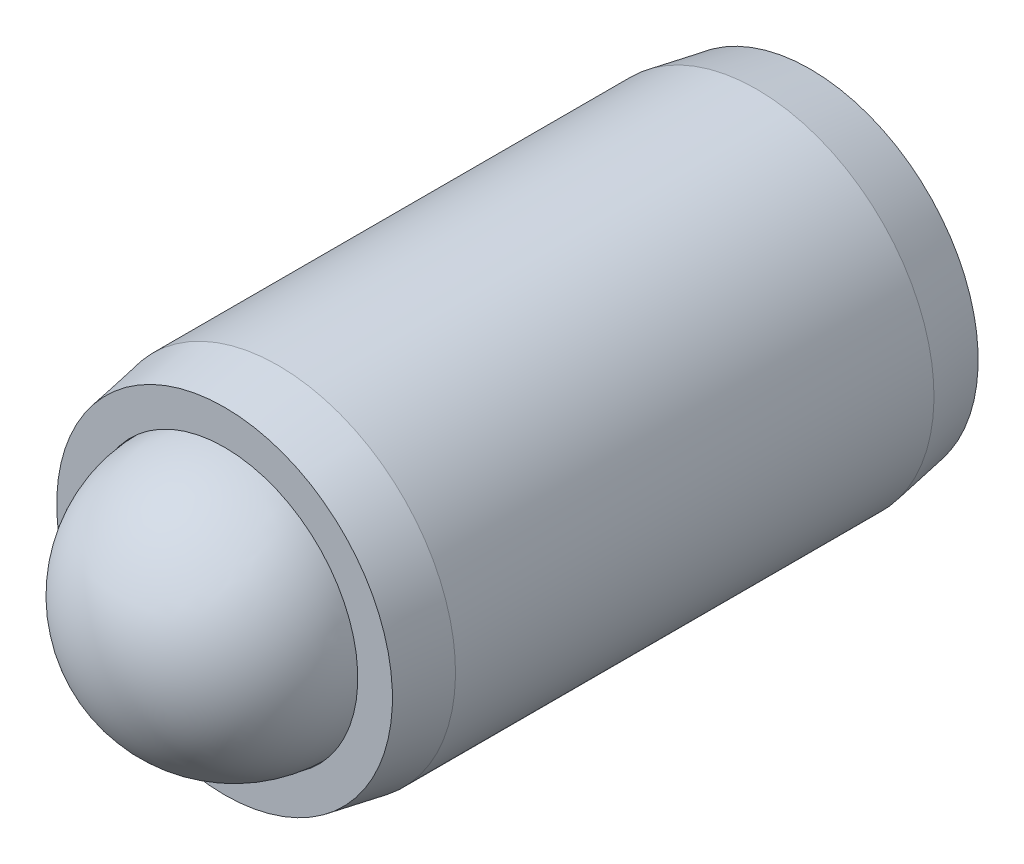
ISO-10303-21;
HEADER;
FILE_DESCRIPTION(('STEP AP214'),'2;1');
FILE_NAME('part.step','',(''),(''),'','','');
FILE_SCHEMA(('AUTOMOTIVE_DESIGN { 1 0 10303 214 1 1 1 1 }'));
ENDSEC;
DATA;
#1=APPLICATION_CONTEXT('core data for automotive mechanical design processes');
#2=APPLICATION_PROTOCOL_DEFINITION('international standard','automotive_design',2000,#1);
#3=PRODUCT_CONTEXT('',#1,'mechanical');
#4=PRODUCT('Part','Part','',(#3));
#5=PRODUCT_RELATED_PRODUCT_CATEGORY('part','',(#4));
#6=PRODUCT_DEFINITION_FORMATION('','',#4);
#7=PRODUCT_DEFINITION_CONTEXT('part definition',#1,'design');
#8=PRODUCT_DEFINITION('design','',#6,#7);
#9=PRODUCT_DEFINITION_SHAPE('','',#8);
#10=(LENGTH_UNIT() NAMED_UNIT(*) SI_UNIT(.MILLI.,.METRE.));
#11=(NAMED_UNIT(*) PLANE_ANGLE_UNIT() SI_UNIT($,.RADIAN.));
#12=(NAMED_UNIT(*) SI_UNIT($,.STERADIAN.) SOLID_ANGLE_UNIT());
#13=UNCERTAINTY_MEASURE_WITH_UNIT(LENGTH_MEASURE(1.E-05),#10,'distance_accuracy_value','');
#14=(GEOMETRIC_REPRESENTATION_CONTEXT(3) GLOBAL_UNCERTAINTY_ASSIGNED_CONTEXT((#13)) GLOBAL_UNIT_ASSIGNED_CONTEXT((#10,
#11,#12)) REPRESENTATION_CONTEXT('',''));
#15=CARTESIAN_POINT('',(0.,0.,0.));
#16=DIRECTION('',(0.,0.,1.));
#17=DIRECTION('',(1.,0.,0.));
#18=AXIS2_PLACEMENT_3D('',#15,#16,#17);
#19=CARTESIAN_POINT('',(3.63880287113716,9.69809230508645,-0.896824962312488));
#20=DIRECTION('',(-0.828677300575052,0.527077894582623,0.188368852398678));
#21=DIRECTION('',(0.543764560000375,0.678290201199728,0.494208970218096));
#22=AXIS2_PLACEMENT_3D('',#19,#20,#21);
#23=SPHERICAL_SURFACE('',#22,3.571875);
#24=CARTESIAN_POINT('',(0.678871138145646,11.5807486597988,-0.223994967650961));
#25=VERTEX_POINT('',#24);
#26=VERTEX_LOOP('',#25);
#27=FACE_BOUND('',#26,.T.);
#28=ADVANCED_FACE('P0_F12',(#27),#23,.T.);
#29=CLOSED_SHELL('',(#28));
#30=MANIFOLD_SOLID_BREP('P0_B1',#29);
#31=CARTESIAN_POINT('',(3.63880287113716,9.69809230508645,-16.3749499623125));
#32=DIRECTION('',(0.,0.,1.));
#33=DIRECTION('',(0.,-1.,0.));
#34=AXIS2_PLACEMENT_3D('',#31,#32,#33);
#35=CONICAL_SURFACE('',#34,4.5085,0.174532925199426);
#36=CARTESIAN_POINT('',(3.63880287113716,9.69809230508645,-14.9344443801295));
#37=DIRECTION('',(0.,0.,-1.));
#38=DIRECTION('',(0.,1.,0.));
#39=AXIS2_PLACEMENT_3D('',#36,#37,#38);
#40=CIRCLE('',#39,4.7625);
#41=CARTESIAN_POINT('',(3.63880287113716,14.4605923050864,-14.9344443801295));
#42=VERTEX_POINT('',#41);
#43=EDGE_CURVE('P1_E149',#42,#42,#40,.T.);
#44=ORIENTED_EDGE('',*,*,#43,.T.);
#45=EDGE_LOOP('',(#44));
#46=FACE_BOUND('',#45,.T.);
#47=CARTESIAN_POINT('',(3.63880287113716,9.69809230508645,-16.3749499623125));
#48=DIRECTION('',(0.,0.,-1.));
#49=DIRECTION('',(0.,1.,0.));
#50=AXIS2_PLACEMENT_3D('',#47,#48,#49);
#51=CIRCLE('',#50,4.5085);
#52=CARTESIAN_POINT('',(3.63880287113716,14.2065923050864,-16.3749499623125));
#53=VERTEX_POINT('',#52);
#54=EDGE_CURVE('P1_E125',#53,#53,#51,.T.);
#55=ORIENTED_EDGE('',*,*,#54,.F.);
#56=EDGE_LOOP('',(#55));
#57=FACE_BOUND('',#56,.T.);
#58=ADVANCED_FACE('P1_F15',(#46,#57),#35,.T.);
#59=CARTESIAN_POINT('',(3.63880287113716,9.69809230508645,-5.94821903041391));
#60=DIRECTION('',(0.,0.,-1.));
#61=DIRECTION('',(0.,1.,0.));
#62=AXIS2_PLACEMENT_3D('',#59,#60,#61);
#63=CYLINDRICAL_SURFACE('',#62,4.7625);
#64=CARTESIAN_POINT('',(3.63880287113716,9.69809230508645,-2.08333054449537));
#65=DIRECTION('',(0.,0.,-1.));
#66=DIRECTION('',(0.,1.,0.));
#67=AXIS2_PLACEMENT_3D('',#64,#65,#66);
#68=CIRCLE('',#67,4.7625);
#69=CARTESIAN_POINT('',(3.63880287113716,14.4605923050864,-2.08333054449537));
#70=VERTEX_POINT('',#69);
#71=EDGE_CURVE('P1_E146',#70,#70,#68,.T.);
#72=ORIENTED_EDGE('',*,*,#71,.T.);
#73=EDGE_LOOP('',(#72));
#74=FACE_BOUND('',#73,.T.);
#75=ORIENTED_EDGE('',*,*,#43,.F.);
#76=EDGE_LOOP('',(#75));
#77=FACE_BOUND('',#76,.T.);
#78=ADVANCED_FACE('P1_F218',(#74,#77),#63,.T.);
#79=CARTESIAN_POINT('',(3.63880287113716,9.69809230508645,-2.08333054449537));
#80=DIRECTION('',(0.,0.,-1.));
#81=DIRECTION('',(0.,1.,0.));
#82=AXIS2_PLACEMENT_3D('',#79,#80,#81);
#83=CONICAL_SURFACE('',#82,4.7625,0.174532925199434);
#84=CARTESIAN_POINT('',(3.63880287113716,9.69809230508645,-0.642824962312487));
#85=DIRECTION('',(0.,0.,-1.));
#86=DIRECTION('',(0.,1.,0.));
#87=AXIS2_PLACEMENT_3D('',#84,#85,#86);
#88=CIRCLE('',#87,4.5085);
#89=CARTESIAN_POINT('',(3.63880287113716,14.2065923050864,-0.642824962312487));
#90=VERTEX_POINT('',#89);
#91=EDGE_CURVE('P1_E143',#90,#90,#88,.T.);
#92=ORIENTED_EDGE('',*,*,#91,.T.);
#93=EDGE_LOOP('',(#92));
#94=FACE_BOUND('',#93,.T.);
#95=ORIENTED_EDGE('',*,*,#71,.F.);
#96=EDGE_LOOP('',(#95));
#97=FACE_BOUND('',#96,.T.);
#98=ADVANCED_FACE('P1_F224',(#94,#97),#83,.T.);
#99=CARTESIAN_POINT('',(3.63880287113716,14.2065923050864,-0.642824962312487));
#100=DIRECTION('',(0.,0.,1.));
#101=DIRECTION('',(0.,-1.,0.));
#102=AXIS2_PLACEMENT_3D('',#99,#100,#101);
#103=PLANE('',#102);
#104=CARTESIAN_POINT('',(3.63880287113716,9.69809230508645,-0.642824962312487));
#105=DIRECTION('',(0.,0.,-1.));
#106=DIRECTION('',(0.,1.,0.));
#107=AXIS2_PLACEMENT_3D('',#104,#105,#106);
#108=CIRCLE('',#107,3.578225);
#109=CARTESIAN_POINT('',(3.63880287113716,13.2763173050864,-0.642824962312487));
#110=VERTEX_POINT('',#109);
#111=EDGE_CURVE('P1_E140',#110,#110,#108,.T.);
#112=ORIENTED_EDGE('',*,*,#111,.T.);
#113=EDGE_LOOP('',(#112));
#114=FACE_BOUND('',#113,.T.);
#115=ORIENTED_EDGE('',*,*,#91,.F.);
#116=EDGE_LOOP('',(#115));
#117=FACE_BOUND('',#116,.T.);
#118=ADVANCED_FACE('P1_F360',(#114,#117),#103,.T.);
#119=CARTESIAN_POINT('',(3.63880287113716,9.69809230508645,-5.94821903041391));
#120=DIRECTION('',(0.,0.,-1.));
#121=DIRECTION('',(0.,1.,0.));
#122=AXIS2_PLACEMENT_3D('',#119,#120,#121);
#123=CYLINDRICAL_SURFACE('',#122,3.578225);
#124=CARTESIAN_POINT('',(3.63880287113716,9.69809230508645,-2.36999403041387));
#125=DIRECTION('',(0.,0.,-1.));
#126=DIRECTION('',(0.,1.,0.));
#127=AXIS2_PLACEMENT_3D('',#124,#125,#126);
#128=CIRCLE('',#127,3.578225);
#129=CARTESIAN_POINT('',(3.63880287113716,13.2763173050864,-2.36999403041387));
#130=VERTEX_POINT('',#129);
#131=EDGE_CURVE('P1_E137',#130,#130,#128,.T.);
#132=ORIENTED_EDGE('',*,*,#131,.T.);
#133=EDGE_LOOP('',(#132));
#134=FACE_BOUND('',#133,.T.);
#135=ORIENTED_EDGE('',*,*,#111,.F.);
#136=EDGE_LOOP('',(#135));
#137=FACE_BOUND('',#136,.T.);
#138=ADVANCED_FACE('P1_F351',(#134,#137),#123,.F.);
#139=CARTESIAN_POINT('',(3.63880287113716,9.69809230508645,-2.36999403041387));
#140=DIRECTION('',(0.,0.,1.));
#141=DIRECTION('',(0.,-1.,0.));
#142=AXIS2_PLACEMENT_3D('',#139,#140,#141);
#143=CONICAL_SURFACE('',#142,3.578225,0.785398163397443);
#144=CARTESIAN_POINT('',(3.63880287113716,9.69809230508645,-5.94821903041391));
#145=VERTEX_POINT('',#144);
#146=VERTEX_LOOP('',#145);
#147=FACE_BOUND('',#146,.T.);
#148=ORIENTED_EDGE('',*,*,#131,.F.);
#149=EDGE_LOOP('',(#148));
#150=FACE_BOUND('',#149,.T.);
#151=ADVANCED_FACE('P1_F342',(#147,#150),#143,.F.);
#152=CARTESIAN_POINT('',(3.63880287113716,14.2065923050864,-16.3749499623125));
#153=DIRECTION('',(0.,0.,-1.));
#154=DIRECTION('',(0.,1.,0.));
#155=AXIS2_PLACEMENT_3D('',#152,#153,#154);
#156=PLANE('',#155);
#157=DIRECTION('',(1.,0.,0.));
#158=VECTOR('',#157,1.);
#159=CARTESIAN_POINT('',(5.01361819964495,7.06284230508645,-16.3749499623125));
#160=LINE('',#159,#158);
#161=CARTESIAN_POINT('',(2.11734057425519,7.06284230508645,-16.3749499623125));
#162=VERTEX_POINT('',#161);
#163=CARTESIAN_POINT('',(5.16026516801912,7.06284230508645,-16.3749499623125));
#164=VERTEX_POINT('',#163);
#165=EDGE_CURVE('P1_E163',#162,#164,#160,.T.);
#166=ORIENTED_EDGE('',*,*,#165,.T.);
#167=DIRECTION('',(0.5,0.866025403784439,0.));
#168=VECTOR('',#167,1.);
#169=CARTESIAN_POINT('',(6.608403980714,9.57109230508645,-16.3749499623125));
#170=LINE('',#169,#168);
#171=CARTESIAN_POINT('',(6.68172746490109,9.69809230508645,-16.3749499623125));
#172=VERTEX_POINT('',#171);
#173=EDGE_CURVE('P1_E165',#164,#172,#170,.T.);
#174=ORIENTED_EDGE('',*,*,#173,.T.);
#175=DIRECTION('',(-0.5,0.866025403784439,0.));
#176=VECTOR('',#175,1.);
#177=CARTESIAN_POINT('',(5.2335886522062,12.2063423050864,-16.3749499623125));
#178=LINE('',#177,#176);
#179=CARTESIAN_POINT('',(5.16026516801912,12.3333423050865,-16.3749499623125));
#180=VERTEX_POINT('',#179);
#181=EDGE_CURVE('P1_E155',#172,#180,#178,.T.);
#182=ORIENTED_EDGE('',*,*,#181,.T.);
#183=DIRECTION('',(-1.,0.,0.));
#184=VECTOR('',#183,1.);
#185=CARTESIAN_POINT('',(2.26398754262936,12.3333423050865,-16.3749499623125));
#186=LINE('',#185,#184);
#187=CARTESIAN_POINT('',(2.1173405742552,12.3333423050865,-16.3749499623125));
#188=VERTEX_POINT('',#187);
#189=EDGE_CURVE('P1_E157',#180,#188,#186,.T.);
#190=ORIENTED_EDGE('',*,*,#189,.T.);
#191=DIRECTION('',(-0.5,-0.866025403784438,0.));
#192=VECTOR('',#191,1.);
#193=CARTESIAN_POINT('',(0.669201761560316,9.82509230508645,-16.3749499623125));
#194=LINE('',#193,#192);
#195=CARTESIAN_POINT('',(0.595878277373234,9.69809230508645,-16.3749499623125));
#196=VERTEX_POINT('',#195);
#197=EDGE_CURVE('P1_E159',#188,#196,#194,.T.);
#198=ORIENTED_EDGE('',*,*,#197,.T.);
#199=DIRECTION('',(0.5,-0.866025403784439,0.));
#200=VECTOR('',#199,1.);
#201=CARTESIAN_POINT('',(2.04401709006811,7.18984230508645,-16.3749499623125));
#202=LINE('',#201,#200);
#203=EDGE_CURVE('P1_E161',#196,#162,#202,.T.);
#204=ORIENTED_EDGE('',*,*,#203,.T.);
#205=EDGE_LOOP('',(#166,#174,#182,#190,#198,#204));
#206=FACE_BOUND('',#205,.T.);
#207=ORIENTED_EDGE('',*,*,#54,.T.);
#208=EDGE_LOOP('',(#207));
#209=FACE_BOUND('',#208,.T.);
#210=ADVANCED_FACE('P1_F334',(#206,#209),#156,.T.);
#211=CARTESIAN_POINT('',(2.26398754262936,7.31684230508645,-11.2949499623125));
#212=DIRECTION('',(-0.866025403784439,-0.5,0.));
#213=DIRECTION('',(0.5,-0.866025403784439,0.));
#214=AXIS2_PLACEMENT_3D('',#211,#212,#213);
#215=PLANE('',#214);
#216=DIRECTION('',(0.,0.,-1.));
#217=VECTOR('',#216,1.);
#218=CARTESIAN_POINT('',(2.26398754262936,7.31684230508645,-11.2949499623125));
#219=LINE('',#218,#217);
#220=CARTESIAN_POINT('',(2.26398754262936,7.31684230508645,-11.2949499623125));
#221=VERTEX_POINT('',#220);
#222=CARTESIAN_POINT('',(2.26398754262936,7.31684230508645,-16.1209499623125));
#223=VERTEX_POINT('',#222);
#224=EDGE_CURVE('P1_E123',#221,#223,#219,.T.);
#225=ORIENTED_EDGE('',*,*,#224,.T.);
#226=DIRECTION('',(-0.5,0.866025403784439,0.));
#227=VECTOR('',#226,1.);
#228=CARTESIAN_POINT('',(0.889172214121565,9.69809230508645,-16.1209499623125));
#229=LINE('',#228,#227);
#230=CARTESIAN_POINT('',(0.889172214121565,9.69809230508645,-16.1209499623125));
#231=VERTEX_POINT('',#230);
#232=EDGE_CURVE('P1_E97',#223,#231,#229,.T.);
#233=ORIENTED_EDGE('',*,*,#232,.T.);
#234=DIRECTION('',(0.,0.,-1.));
#235=VECTOR('',#234,1.);
#236=CARTESIAN_POINT('',(0.889172214121565,9.69809230508645,-11.2949499623125));
#237=LINE('',#236,#235);
#238=CARTESIAN_POINT('',(0.889172214121565,9.69809230508645,-11.2949499623125));
#239=VERTEX_POINT('',#238);
#240=EDGE_CURVE('P1_E89',#239,#231,#237,.T.);
#241=ORIENTED_EDGE('',*,*,#240,.F.);
#242=DIRECTION('',(-0.5,0.866025403784439,0.));
#243=VECTOR('',#242,1.);
#244=CARTESIAN_POINT('',(2.26398754262936,7.31684230508645,-11.2949499623125));
#245=LINE('',#244,#243);
#246=EDGE_CURVE('P1_E94',#221,#239,#245,.T.);
#247=ORIENTED_EDGE('',*,*,#246,.F.);
#248=EDGE_LOOP('',(#225,#233,#241,#247));
#249=FACE_BOUND('',#248,.T.);
#250=ADVANCED_FACE('P1_F92',(#249),#215,.F.);
#251=CARTESIAN_POINT('',(5.01361819964495,7.31684230508645,-11.2949499623125));
#252=DIRECTION('',(0.,-1.,0.));
#253=DIRECTION('',(1.,0.,0.));
#254=AXIS2_PLACEMENT_3D('',#251,#252,#253);
#255=PLANE('',#254);
#256=DIRECTION('',(0.,0.,-1.));
#257=VECTOR('',#256,1.);
#258=CARTESIAN_POINT('',(5.01361819964495,7.31684230508645,-11.2949499623125));
#259=LINE('',#258,#257);
#260=CARTESIAN_POINT('',(5.01361819964495,7.31684230508645,-11.2949499623125));
#261=VERTEX_POINT('',#260);
#262=CARTESIAN_POINT('',(5.01361819964495,7.31684230508645,-16.1209499623125));
#263=VERTEX_POINT('',#262);
#264=EDGE_CURVE('P1_E126',#261,#263,#259,.T.);
#265=ORIENTED_EDGE('',*,*,#264,.T.);
#266=DIRECTION('',(-1.,0.,0.));
#267=VECTOR('',#266,1.);
#268=CARTESIAN_POINT('',(2.26398754262936,7.31684230508645,-16.1209499623125));
#269=LINE('',#268,#267);
#270=EDGE_CURVE('P1_E168',#263,#223,#269,.T.);
#271=ORIENTED_EDGE('',*,*,#270,.T.);
#272=ORIENTED_EDGE('',*,*,#224,.F.);
#273=DIRECTION('',(-1.,0.,0.));
#274=VECTOR('',#273,1.);
#275=CARTESIAN_POINT('',(5.01361819964495,7.31684230508645,-11.2949499623125));
#276=LINE('',#275,#274);
#277=EDGE_CURVE('P1_E99',#261,#221,#276,.T.);
#278=ORIENTED_EDGE('',*,*,#277,.F.);
#279=EDGE_LOOP('',(#265,#271,#272,#278));
#280=FACE_BOUND('',#279,.T.);
#281=ADVANCED_FACE('P1_F252',(#280),#255,.F.);
#282=CARTESIAN_POINT('',(6.38843352815275,9.69809230508645,-11.2949499623125));
#283=DIRECTION('',(0.866025403784438,-0.5,0.));
#284=DIRECTION('',(0.5,0.866025403784438,0.));
#285=AXIS2_PLACEMENT_3D('',#282,#283,#284);
#286=PLANE('',#285);
#287=DIRECTION('',(0.,0.,-1.));
#288=VECTOR('',#287,1.);
#289=CARTESIAN_POINT('',(6.38843352815275,9.69809230508645,-11.2949499623125));
#290=LINE('',#289,#288);
#291=CARTESIAN_POINT('',(6.38843352815275,9.69809230508645,-11.2949499623125));
#292=VERTEX_POINT('',#291);
#293=CARTESIAN_POINT('',(6.38843352815275,9.69809230508645,-16.1209499623125));
#294=VERTEX_POINT('',#293);
#295=EDGE_CURVE('P1_E129',#292,#294,#290,.T.);
#296=ORIENTED_EDGE('',*,*,#295,.T.);
#297=DIRECTION('',(-0.5,-0.866025403784438,0.));
#298=VECTOR('',#297,1.);
#299=CARTESIAN_POINT('',(5.01361819964495,7.31684230508645,-16.1209499623125));
#300=LINE('',#299,#298);
#301=EDGE_CURVE('P1_E152',#294,#263,#300,.T.);
#302=ORIENTED_EDGE('',*,*,#301,.T.);
#303=ORIENTED_EDGE('',*,*,#264,.F.);
#304=DIRECTION('',(-0.5,-0.866025403784438,0.));
#305=VECTOR('',#304,1.);
#306=CARTESIAN_POINT('',(6.38843352815275,9.69809230508645,-11.2949499623125));
#307=LINE('',#306,#305);
#308=EDGE_CURVE('P1_E120',#292,#261,#307,.T.);
#309=ORIENTED_EDGE('',*,*,#308,.F.);
#310=EDGE_LOOP('',(#296,#302,#303,#309));
#311=FACE_BOUND('',#310,.T.);
#312=ADVANCED_FACE('P1_F206',(#311),#286,.F.);
#313=CARTESIAN_POINT('',(5.01361819964495,12.0793423050864,-11.2949499623125));
#314=DIRECTION('',(0.866025403784438,0.5,0.));
#315=DIRECTION('',(-0.5,0.866025403784439,0.));
#316=AXIS2_PLACEMENT_3D('',#313,#314,#315);
#317=PLANE('',#316);
#318=DIRECTION('',(0.,0.,-1.));
#319=VECTOR('',#318,1.);
#320=CARTESIAN_POINT('',(5.01361819964495,12.0793423050864,-11.2949499623125));
#321=LINE('',#320,#319);
#322=CARTESIAN_POINT('',(5.01361819964495,12.0793423050864,-11.2949499623125));
#323=VERTEX_POINT('',#322);
#324=CARTESIAN_POINT('',(5.01361819964495,12.0793423050864,-16.1209499623125));
#325=VERTEX_POINT('',#324);
#326=EDGE_CURVE('P1_E132',#323,#325,#321,.T.);
#327=ORIENTED_EDGE('',*,*,#326,.T.);
#328=DIRECTION('',(0.5,-0.866025403784439,0.));
#329=VECTOR('',#328,1.);
#330=CARTESIAN_POINT('',(6.38843352815275,9.69809230508645,-16.1209499623125));
#331=LINE('',#330,#329);
#332=EDGE_CURVE('P1_E10',#325,#294,#331,.T.);
#333=ORIENTED_EDGE('',*,*,#332,.T.);
#334=ORIENTED_EDGE('',*,*,#295,.F.);
#335=DIRECTION('',(0.5,-0.866025403784439,0.));
#336=VECTOR('',#335,1.);
#337=CARTESIAN_POINT('',(5.01361819964495,12.0793423050864,-11.2949499623125));
#338=LINE('',#337,#336);
#339=EDGE_CURVE('P1_E117',#323,#292,#338,.T.);
#340=ORIENTED_EDGE('',*,*,#339,.F.);
#341=EDGE_LOOP('',(#327,#333,#334,#340));
#342=FACE_BOUND('',#341,.T.);
#343=ADVANCED_FACE('P1_F202',(#342),#317,.F.);
#344=CARTESIAN_POINT('',(2.26398754262936,12.0793423050864,-11.2949499623125));
#345=DIRECTION('',(0.,1.,0.));
#346=DIRECTION('',(0.,0.,1.));
#347=AXIS2_PLACEMENT_3D('',#344,#345,#346);
#348=PLANE('',#347);
#349=DIRECTION('',(0.,0.,-1.));
#350=VECTOR('',#349,1.);
#351=CARTESIAN_POINT('',(2.26398754262936,12.0793423050864,-11.2949499623125));
#352=LINE('',#351,#350);
#353=CARTESIAN_POINT('',(2.26398754262936,12.0793423050864,-11.2949499623125));
#354=VERTEX_POINT('',#353);
#355=CARTESIAN_POINT('',(2.26398754262936,12.0793423050864,-16.1209499623125));
#356=VERTEX_POINT('',#355);
#357=EDGE_CURVE('P1_E98',#354,#356,#352,.T.);
#358=ORIENTED_EDGE('',*,*,#357,.T.);
#359=DIRECTION('',(1.,0.,0.));
#360=VECTOR('',#359,1.);
#361=CARTESIAN_POINT('',(5.01361819964495,12.0793423050864,-16.1209499623125));
#362=LINE('',#361,#360);
#363=EDGE_CURVE('P1_E24',#356,#325,#362,.T.);
#364=ORIENTED_EDGE('',*,*,#363,.T.);
#365=ORIENTED_EDGE('',*,*,#326,.F.);
#366=DIRECTION('',(1.,0.,0.));
#367=VECTOR('',#366,1.);
#368=CARTESIAN_POINT('',(2.26398754262936,12.0793423050864,-11.2949499623125));
#369=LINE('',#368,#367);
#370=EDGE_CURVE('P1_E107',#354,#323,#369,.T.);
#371=ORIENTED_EDGE('',*,*,#370,.F.);
#372=EDGE_LOOP('',(#358,#364,#365,#371));
#373=FACE_BOUND('',#372,.T.);
#374=ADVANCED_FACE('P1_F207',(#373),#348,.F.);
#375=CARTESIAN_POINT('',(0.889172214121565,9.69809230508645,-11.2949499623125));
#376=DIRECTION('',(-0.866025403784438,0.5,0.));
#377=DIRECTION('',(-0.5,-0.866025403784438,0.));
#378=AXIS2_PLACEMENT_3D('',#375,#376,#377);
#379=PLANE('',#378);
#380=ORIENTED_EDGE('',*,*,#240,.T.);
#381=DIRECTION('',(0.5,0.866025403784438,0.));
#382=VECTOR('',#381,1.);
#383=CARTESIAN_POINT('',(2.26398754262936,12.0793423050864,-16.1209499623125));
#384=LINE('',#383,#382);
#385=EDGE_CURVE('P1_E39',#231,#356,#384,.T.);
#386=ORIENTED_EDGE('',*,*,#385,.T.);
#387=ORIENTED_EDGE('',*,*,#357,.F.);
#388=DIRECTION('',(0.5,0.866025403784438,0.));
#389=VECTOR('',#388,1.);
#390=CARTESIAN_POINT('',(0.889172214121565,9.69809230508645,-11.2949499623125));
#391=LINE('',#390,#389);
#392=EDGE_CURVE('P1_E102',#239,#354,#391,.T.);
#393=ORIENTED_EDGE('',*,*,#392,.F.);
#394=EDGE_LOOP('',(#380,#386,#387,#393));
#395=FACE_BOUND('',#394,.T.);
#396=ADVANCED_FACE('P1_F103',(#395),#379,.F.);
#397=CARTESIAN_POINT('',(3.63880287113716,9.69809230508645,-11.2949499623125));
#398=DIRECTION('',(0.,0.,-1.));
#399=DIRECTION('',(0.,1.,0.));
#400=AXIS2_PLACEMENT_3D('',#397,#398,#399);
#401=PLANE('',#400);
#402=ORIENTED_EDGE('',*,*,#246,.T.);
#403=ORIENTED_EDGE('',*,*,#392,.T.);
#404=ORIENTED_EDGE('',*,*,#370,.T.);
#405=ORIENTED_EDGE('',*,*,#339,.T.);
#406=ORIENTED_EDGE('',*,*,#308,.T.);
#407=ORIENTED_EDGE('',*,*,#277,.T.);
#408=EDGE_LOOP('',(#402,#403,#404,#405,#406,#407));
#409=FACE_BOUND('',#408,.T.);
#410=ADVANCED_FACE('P1_F109',(#409),#401,.T.);
#411=CARTESIAN_POINT('',(0.889172214121565,9.69809230508645,-16.1209499623125));
#412=DIRECTION('',(0.612372435695791,-0.353553390593272,-0.707106781186551));
#413=DIRECTION('',(-0.5,-0.866025403784438,0.));
#414=AXIS2_PLACEMENT_3D('',#411,#412,#413);
#415=PLANE('',#414);
#416=DIRECTION('',(-0.755928946018458,0.,-0.654653670707974));
#417=VECTOR('',#416,1.);
#418=CARTESIAN_POINT('',(1.67478097326888,9.69809230508645,-15.4405928194553));
#419=LINE('',#418,#417);
#420=EDGE_CURVE('P1_E114',#196,#231,#419,.F.);
#421=ORIENTED_EDGE('',*,*,#420,.F.);
#422=ORIENTED_EDGE('',*,*,#197,.F.);
#423=DIRECTION('',(-0.377964473009228,0.65465367070798,-0.654653670707973));
#424=VECTOR('',#423,1.);
#425=CARTESIAN_POINT('',(2.65679192220302,11.3989851622293,-15.4405928194553));
#426=LINE('',#425,#424);
#427=EDGE_CURVE('P1_E19',#356,#188,#426,.T.);
#428=ORIENTED_EDGE('',*,*,#427,.F.);
#429=ORIENTED_EDGE('',*,*,#385,.F.);
#430=EDGE_LOOP('',(#421,#422,#428,#429));
#431=FACE_BOUND('',#430,.T.);
#432=ADVANCED_FACE('P1_F17',(#431),#415,.T.);
#433=CARTESIAN_POINT('',(2.26398754262936,12.0793423050864,-16.1209499623125));
#434=DIRECTION('',(0.,-0.707106781186544,-0.707106781186551));
#435=DIRECTION('',(-1.,0.,0.));
#436=AXIS2_PLACEMENT_3D('',#433,#434,#435);
#437=PLANE('',#436);
#438=ORIENTED_EDGE('',*,*,#427,.T.);
#439=ORIENTED_EDGE('',*,*,#189,.F.);
#440=DIRECTION('',(0.377964473009227,0.654653670707981,-0.654653670707974));
#441=VECTOR('',#440,1.);
#442=CARTESIAN_POINT('',(4.6208138200713,11.3989851622293,-15.4405928194553));
#443=LINE('',#442,#441);
#444=EDGE_CURVE('P1_E180',#325,#180,#443,.T.);
#445=ORIENTED_EDGE('',*,*,#444,.F.);
#446=ORIENTED_EDGE('',*,*,#363,.F.);
#447=EDGE_LOOP('',(#438,#439,#445,#446));
#448=FACE_BOUND('',#447,.T.);
#449=ADVANCED_FACE('P1_F194',(#448),#437,.T.);
#450=CARTESIAN_POINT('',(2.26398754262936,7.31684230508645,-16.1209499623125));
#451=DIRECTION('',(0.612372435695792,0.353553390593272,-0.707106781186551));
#452=DIRECTION('',(0.5,-0.866025403784439,0.));
#453=AXIS2_PLACEMENT_3D('',#450,#451,#452);
#454=PLANE('',#453);
#455=ORIENTED_EDGE('',*,*,#420,.T.);
#456=ORIENTED_EDGE('',*,*,#232,.F.);
#457=DIRECTION('',(-0.377964473009229,-0.654653670707979,-0.654653670707974));
#458=VECTOR('',#457,1.);
#459=CARTESIAN_POINT('',(2.65679192220302,7.9971994479436,-15.4405928194553));
#460=LINE('',#459,#458);
#461=EDGE_CURVE('P1_E177',#162,#223,#460,.F.);
#462=ORIENTED_EDGE('',*,*,#461,.F.);
#463=ORIENTED_EDGE('',*,*,#203,.F.);
#464=EDGE_LOOP('',(#455,#456,#462,#463));
#465=FACE_BOUND('',#464,.T.);
#466=ADVANCED_FACE('P1_F186',(#465),#454,.T.);
#467=CARTESIAN_POINT('',(5.01361819964495,12.0793423050864,-16.1209499623125));
#468=DIRECTION('',(-0.612372435695792,-0.353553390593272,-0.70710678118655));
#469=DIRECTION('',(-0.5,0.866025403784439,0.));
#470=AXIS2_PLACEMENT_3D('',#467,#468,#469);
#471=PLANE('',#470);
#472=ORIENTED_EDGE('',*,*,#444,.T.);
#473=ORIENTED_EDGE('',*,*,#181,.F.);
#474=DIRECTION('',(-0.755928946018458,0.,0.654653670707973));
#475=VECTOR('',#474,1.);
#476=CARTESIAN_POINT('',(6.38843352815275,9.69809230508645,-16.1209499623125));
#477=LINE('',#476,#475);
#478=EDGE_CURVE('P1_E175',#294,#172,#477,.F.);
#479=ORIENTED_EDGE('',*,*,#478,.F.);
#480=ORIENTED_EDGE('',*,*,#332,.F.);
#481=EDGE_LOOP('',(#472,#473,#479,#480));
#482=FACE_BOUND('',#481,.T.);
#483=ADVANCED_FACE('P1_F199',(#482),#471,.T.);
#484=CARTESIAN_POINT('',(5.01361819964495,7.31684230508645,-16.1209499623125));
#485=DIRECTION('',(0.,0.707106781186544,-0.70710678118655));
#486=DIRECTION('',(1.,0.,0.));
#487=AXIS2_PLACEMENT_3D('',#484,#485,#486);
#488=PLANE('',#487);
#489=ORIENTED_EDGE('',*,*,#461,.T.);
#490=ORIENTED_EDGE('',*,*,#270,.F.);
#491=DIRECTION('',(0.37796447300923,-0.654653670707979,-0.654653670707974));
#492=VECTOR('',#491,1.);
#493=CARTESIAN_POINT('',(4.6208138200713,7.99719944794359,-15.4405928194553));
#494=LINE('',#493,#492);
#495=EDGE_CURVE('P1_E173',#164,#263,#494,.F.);
#496=ORIENTED_EDGE('',*,*,#495,.F.);
#497=ORIENTED_EDGE('',*,*,#165,.F.);
#498=EDGE_LOOP('',(#489,#490,#496,#497));
#499=FACE_BOUND('',#498,.T.);
#500=ADVANCED_FACE('P1_F233',(#499),#488,.T.);
#501=CARTESIAN_POINT('',(6.38843352815275,9.69809230508645,-16.1209499623125));
#502=DIRECTION('',(-0.612372435695791,0.353553390593272,-0.707106781186552));
#503=DIRECTION('',(0.5,0.866025403784438,0.));
#504=AXIS2_PLACEMENT_3D('',#501,#502,#503);
#505=PLANE('',#504);
#506=ORIENTED_EDGE('',*,*,#478,.T.);
#507=ORIENTED_EDGE('',*,*,#173,.F.);
#508=ORIENTED_EDGE('',*,*,#495,.T.);
#509=ORIENTED_EDGE('',*,*,#301,.F.);
#510=EDGE_LOOP('',(#506,#507,#508,#509));
#511=FACE_BOUND('',#510,.T.);
#512=ADVANCED_FACE('P1_F230',(#511),#505,.T.);
#513=CLOSED_SHELL('',(#58,#78,#98,#118,#138,#151,#210,#250,#281,#312,#343,#374,#396,#410,#432,
#449,#466,#483,#500,#512));
#514=MANIFOLD_SOLID_BREP('P1_B1',#513);
#515=ADVANCED_BREP_SHAPE_REPRESENTATION('',(#18,#30,#514),#14);
#516=SHAPE_DEFINITION_REPRESENTATION(#9,#515);
ENDSEC;
END-ISO-10303-21;
